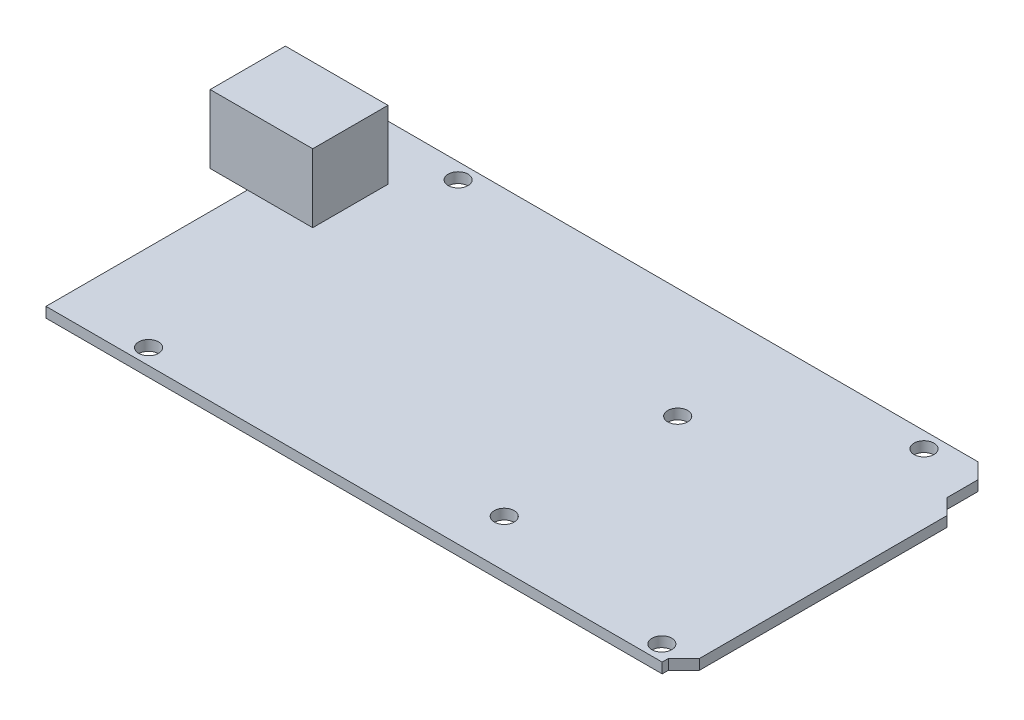
ISO-10303-21;
HEADER;
FILE_DESCRIPTION(('STEP AP214'),'2;1');
FILE_NAME('part.step','',(''),(''),'','','');
FILE_SCHEMA(('AUTOMOTIVE_DESIGN { 1 0 10303 214 1 1 1 1 }'));
ENDSEC;
DATA;
#1=APPLICATION_CONTEXT('core data for automotive mechanical design processes');
#2=APPLICATION_PROTOCOL_DEFINITION('international standard','automotive_design',2000,#1);
#3=PRODUCT_CONTEXT('',#1,'mechanical');
#4=PRODUCT('Part','Part','',(#3));
#5=PRODUCT_RELATED_PRODUCT_CATEGORY('part','',(#4));
#6=PRODUCT_DEFINITION_FORMATION('','',#4);
#7=PRODUCT_DEFINITION_CONTEXT('part definition',#1,'design');
#8=PRODUCT_DEFINITION('design','',#6,#7);
#9=PRODUCT_DEFINITION_SHAPE('','',#8);
#10=(LENGTH_UNIT() NAMED_UNIT(*) SI_UNIT(.MILLI.,.METRE.));
#11=(NAMED_UNIT(*) PLANE_ANGLE_UNIT() SI_UNIT($,.RADIAN.));
#12=(NAMED_UNIT(*) SI_UNIT($,.STERADIAN.) SOLID_ANGLE_UNIT());
#13=UNCERTAINTY_MEASURE_WITH_UNIT(LENGTH_MEASURE(1.E-05),#10,'distance_accuracy_value','');
#14=(GEOMETRIC_REPRESENTATION_CONTEXT(3) GLOBAL_UNCERTAINTY_ASSIGNED_CONTEXT((#13)) GLOBAL_UNIT_ASSIGNED_CONTEXT((#10,
#11,#12)) REPRESENTATION_CONTEXT('',''));
#15=CARTESIAN_POINT('',(0.,0.,0.));
#16=DIRECTION('',(0.,0.,1.));
#17=DIRECTION('',(1.,0.,0.));
#18=AXIS2_PLACEMENT_3D('',#15,#16,#17);
#19=CARTESIAN_POINT('',(0.,1.65,0.));
#20=DIRECTION('',(0.,-1.,0.));
#21=DIRECTION('',(0.,0.,-1.));
#22=AXIS2_PLACEMENT_3D('',#19,#20,#21);
#23=PLANE('',#22);
#24=CARTESIAN_POINT('',(66.1,1.65,-7.6));
#25=DIRECTION('',(0.,1.,0.));
#26=DIRECTION('',(0.,0.,1.));
#27=AXIS2_PLACEMENT_3D('',#24,#25,#26);
#28=CIRCLE('',#27,1.6);
#29=CARTESIAN_POINT('',(66.1,1.65,-5.99999999999999));
#30=VERTEX_POINT('',#29);
#31=EDGE_CURVE('E168',#30,#30,#28,.T.);
#32=ORIENTED_EDGE('',*,*,#31,.F.);
#33=EDGE_LOOP('',(#32));
#34=FACE_BOUND('',#33,.T.);
#35=CARTESIAN_POINT('',(66.1,1.65,-35.5));
#36=DIRECTION('',(0.,1.,0.));
#37=DIRECTION('',(0.,0.,1.));
#38=AXIS2_PLACEMENT_3D('',#35,#36,#37);
#39=CIRCLE('',#38,1.60000000000001);
#40=CARTESIAN_POINT('',(66.1,1.65,-33.9));
#41=VERTEX_POINT('',#40);
#42=EDGE_CURVE('E177',#41,#41,#39,.T.);
#43=ORIENTED_EDGE('',*,*,#42,.F.);
#44=EDGE_LOOP('',(#43));
#45=FACE_BOUND('',#44,.T.);
#46=CARTESIAN_POINT('',(90.454,1.65,-50.76));
#47=DIRECTION('',(0.,1.,0.));
#48=DIRECTION('',(0.,0.,1.));
#49=AXIS2_PLACEMENT_3D('',#46,#47,#48);
#50=CIRCLE('',#49,1.60000000000001);
#51=CARTESIAN_POINT('',(90.454,1.65,-49.16));
#52=VERTEX_POINT('',#51);
#53=EDGE_CURVE('E183',#52,#52,#50,.T.);
#54=ORIENTED_EDGE('',*,*,#53,.F.);
#55=EDGE_LOOP('',(#54));
#56=FACE_BOUND('',#55,.T.);
#57=CARTESIAN_POINT('',(15.524,1.65,-50.76));
#58=DIRECTION('',(0.,1.,0.));
#59=DIRECTION('',(0.,0.,1.));
#60=AXIS2_PLACEMENT_3D('',#57,#58,#59);
#61=CIRCLE('',#60,1.60000000000001);
#62=CARTESIAN_POINT('',(15.524,1.65,-49.16));
#63=VERTEX_POINT('',#62);
#64=EDGE_CURVE('E189',#63,#63,#61,.T.);
#65=ORIENTED_EDGE('',*,*,#64,.F.);
#66=EDGE_LOOP('',(#65));
#67=FACE_BOUND('',#66,.T.);
#68=CARTESIAN_POINT('',(96.55,1.65,-2.5));
#69=DIRECTION('',(0.,1.,0.));
#70=DIRECTION('',(0.,0.,1.));
#71=AXIS2_PLACEMENT_3D('',#68,#69,#70);
#72=CIRCLE('',#71,1.60000000000001);
#73=CARTESIAN_POINT('',(96.55,1.65,-0.899999999999995));
#74=VERTEX_POINT('',#73);
#75=EDGE_CURVE('E195',#74,#74,#72,.T.);
#76=ORIENTED_EDGE('',*,*,#75,.F.);
#77=EDGE_LOOP('',(#76));
#78=FACE_BOUND('',#77,.T.);
#79=CARTESIAN_POINT('',(14.,1.65,-2.5));
#80=DIRECTION('',(0.,1.,0.));
#81=DIRECTION('',(0.,0.,1.));
#82=AXIS2_PLACEMENT_3D('',#79,#80,#81);
#83=CIRCLE('',#82,1.6);
#84=CARTESIAN_POINT('',(14.,1.65,-0.899999999999998));
#85=VERTEX_POINT('',#84);
#86=EDGE_CURVE('E201',#85,#85,#83,.T.);
#87=ORIENTED_EDGE('',*,*,#86,.F.);
#88=EDGE_LOOP('',(#87));
#89=FACE_BOUND('',#88,.T.);
#90=DIRECTION('',(-1.,0.,0.));
#91=VECTOR('',#90,1.);
#92=CARTESIAN_POINT('',(-6.,1.65,-44.5));
#93=LINE('',#92,#91);
#94=CARTESIAN_POINT('',(10.5,1.65,-44.5));
#95=VERTEX_POINT('',#94);
#96=CARTESIAN_POINT('',(0.,1.65,-44.5));
#97=VERTEX_POINT('',#96);
#98=EDGE_CURVE('E56',#95,#97,#93,.T.);
#99=ORIENTED_EDGE('',*,*,#98,.F.);
#100=DIRECTION('',(0.,0.,-1.));
#101=VECTOR('',#100,1.);
#102=CARTESIAN_POINT('',(10.5,1.65,-44.5));
#103=LINE('',#102,#101);
#104=CARTESIAN_POINT('',(10.5,1.65,-32.4));
#105=VERTEX_POINT('',#104);
#106=EDGE_CURVE('E300',#105,#95,#103,.T.);
#107=ORIENTED_EDGE('',*,*,#106,.F.);
#108=DIRECTION('',(1.,0.,0.));
#109=VECTOR('',#108,1.);
#110=CARTESIAN_POINT('',(-6.,1.65,-32.4));
#111=LINE('',#110,#109);
#112=CARTESIAN_POINT('',(0.,1.65,-32.4));
#113=VERTEX_POINT('',#112);
#114=EDGE_CURVE('E11',#113,#105,#111,.T.);
#115=ORIENTED_EDGE('',*,*,#114,.F.);
#116=DIRECTION('',(0.,0.,1.));
#117=VECTOR('',#116,1.);
#118=CARTESIAN_POINT('',(0.,1.65,0.));
#119=LINE('',#118,#117);
#120=CARTESIAN_POINT('',(0.,1.65,0.));
#121=VERTEX_POINT('',#120);
#122=EDGE_CURVE('E211',#113,#121,#119,.T.);
#123=ORIENTED_EDGE('',*,*,#122,.T.);
#124=DIRECTION('',(1.,0.,0.));
#125=VECTOR('',#124,1.);
#126=CARTESIAN_POINT('',(0.,1.65,0.));
#127=LINE('',#126,#125);
#128=CARTESIAN_POINT('',(99.1,1.65,0.));
#129=VERTEX_POINT('',#128);
#130=EDGE_CURVE('E209',#121,#129,#127,.T.);
#131=ORIENTED_EDGE('',*,*,#130,.T.);
#132=DIRECTION('',(0.,0.,-1.));
#133=VECTOR('',#132,1.);
#134=CARTESIAN_POINT('',(99.1,1.65,0.));
#135=LINE('',#134,#133);
#136=CARTESIAN_POINT('',(99.1,1.65,-1.00000000000001));
#137=VERTEX_POINT('',#136);
#138=EDGE_CURVE('E213',#129,#137,#135,.T.);
#139=ORIENTED_EDGE('',*,*,#138,.T.);
#140=DIRECTION('',(0.707106781186549,0.,-0.707106781186547));
#141=VECTOR('',#140,1.);
#142=CARTESIAN_POINT('',(99.1,1.65,-1.00000000000001));
#143=LINE('',#142,#141);
#144=CARTESIAN_POINT('',(101.6,1.65,-3.5));
#145=VERTEX_POINT('',#144);
#146=EDGE_CURVE('E215',#137,#145,#143,.T.);
#147=ORIENTED_EDGE('',*,*,#146,.T.);
#148=DIRECTION('',(0.,0.,-1.));
#149=VECTOR('',#148,1.);
#150=CARTESIAN_POINT('',(101.6,1.65,-3.5));
#151=LINE('',#150,#149);
#152=CARTESIAN_POINT('',(101.6,1.65,-43.3));
#153=VERTEX_POINT('',#152);
#154=EDGE_CURVE('E217',#145,#153,#151,.T.);
#155=ORIENTED_EDGE('',*,*,#154,.T.);
#156=DIRECTION('',(-0.707106781186543,0.,-0.707106781186552));
#157=VECTOR('',#156,1.);
#158=CARTESIAN_POINT('',(101.6,1.65,-43.3));
#159=LINE('',#158,#157);
#160=CARTESIAN_POINT('',(99.1,1.65,-45.8));
#161=VERTEX_POINT('',#160);
#162=EDGE_CURVE('E219',#153,#161,#159,.T.);
#163=ORIENTED_EDGE('',*,*,#162,.T.);
#164=DIRECTION('',(0.,0.,-1.));
#165=VECTOR('',#164,1.);
#166=CARTESIAN_POINT('',(99.1,1.65,-45.8));
#167=LINE('',#166,#165);
#168=CARTESIAN_POINT('',(99.1,1.65,-50.8));
#169=VERTEX_POINT('',#168);
#170=EDGE_CURVE('E221',#161,#169,#167,.T.);
#171=ORIENTED_EDGE('',*,*,#170,.T.);
#172=DIRECTION('',(-0.707106781186551,0.,-0.707106781186545));
#173=VECTOR('',#172,1.);
#174=CARTESIAN_POINT('',(99.1,1.65,-50.8));
#175=LINE('',#174,#173);
#176=CARTESIAN_POINT('',(96.6,1.65,-53.3));
#177=VERTEX_POINT('',#176);
#178=EDGE_CURVE('E223',#169,#177,#175,.T.);
#179=ORIENTED_EDGE('',*,*,#178,.T.);
#180=DIRECTION('',(-1.,0.,0.));
#181=VECTOR('',#180,1.);
#182=CARTESIAN_POINT('',(0.,1.65,-53.3));
#183=LINE('',#182,#181);
#184=CARTESIAN_POINT('',(0.,1.65,-53.3));
#185=VERTEX_POINT('',#184);
#186=EDGE_CURVE('E225',#177,#185,#183,.T.);
#187=ORIENTED_EDGE('',*,*,#186,.T.);
#188=EDGE_CURVE('E207',#185,#97,#119,.T.);
#189=ORIENTED_EDGE('',*,*,#188,.T.);
#190=EDGE_LOOP('',(#99,#107,#115,#123,#131,#139,#147,#155,#163,#171,#179,#187,#189));
#191=FACE_BOUND('',#190,.T.);
#192=ADVANCED_FACE('F39',(#34,#45,#56,#67,#78,#89,#191),#23,.F.);
#193=CARTESIAN_POINT('',(0.,0.,0.));
#194=DIRECTION('',(0.,-1.,0.));
#195=DIRECTION('',(0.,0.,-1.));
#196=AXIS2_PLACEMENT_3D('',#193,#194,#195);
#197=PLANE('',#196);
#198=CARTESIAN_POINT('',(66.1,0.,-35.5));
#199=DIRECTION('',(0.,1.,0.));
#200=DIRECTION('',(0.,0.,1.));
#201=AXIS2_PLACEMENT_3D('',#198,#199,#200);
#202=CIRCLE('',#201,1.60000000000001);
#203=CARTESIAN_POINT('',(66.1,0.,-33.9));
#204=VERTEX_POINT('',#203);
#205=EDGE_CURVE('E175',#204,#204,#202,.T.);
#206=ORIENTED_EDGE('',*,*,#205,.T.);
#207=EDGE_LOOP('',(#206));
#208=FACE_BOUND('',#207,.T.);
#209=CARTESIAN_POINT('',(15.524,0.,-50.76));
#210=DIRECTION('',(0.,1.,0.));
#211=DIRECTION('',(0.,0.,1.));
#212=AXIS2_PLACEMENT_3D('',#209,#210,#211);
#213=CIRCLE('',#212,1.60000000000001);
#214=CARTESIAN_POINT('',(15.524,0.,-49.16));
#215=VERTEX_POINT('',#214);
#216=EDGE_CURVE('E186',#215,#215,#213,.T.);
#217=ORIENTED_EDGE('',*,*,#216,.T.);
#218=EDGE_LOOP('',(#217));
#219=FACE_BOUND('',#218,.T.);
#220=CARTESIAN_POINT('',(14.,0.,-2.5));
#221=DIRECTION('',(0.,1.,0.));
#222=DIRECTION('',(0.,0.,1.));
#223=AXIS2_PLACEMENT_3D('',#220,#221,#222);
#224=CIRCLE('',#223,1.6);
#225=CARTESIAN_POINT('',(14.,0.,-0.899999999999998));
#226=VERTEX_POINT('',#225);
#227=EDGE_CURVE('E198',#226,#226,#224,.T.);
#228=ORIENTED_EDGE('',*,*,#227,.T.);
#229=EDGE_LOOP('',(#228));
#230=FACE_BOUND('',#229,.T.);
#231=DIRECTION('',(0.,0.,1.));
#232=VECTOR('',#231,1.);
#233=CARTESIAN_POINT('',(0.,0.,0.));
#234=LINE('',#233,#232);
#235=CARTESIAN_POINT('',(0.,0.,-53.3));
#236=VERTEX_POINT('',#235);
#237=CARTESIAN_POINT('',(0.,0.,0.));
#238=VERTEX_POINT('',#237);
#239=EDGE_CURVE('E204',#236,#238,#234,.T.);
#240=ORIENTED_EDGE('',*,*,#239,.F.);
#241=DIRECTION('',(-1.,0.,0.));
#242=VECTOR('',#241,1.);
#243=CARTESIAN_POINT('',(0.,0.,-53.3));
#244=LINE('',#243,#242);
#245=CARTESIAN_POINT('',(96.6,0.,-53.3));
#246=VERTEX_POINT('',#245);
#247=EDGE_CURVE('E244',#246,#236,#244,.T.);
#248=ORIENTED_EDGE('',*,*,#247,.F.);
#249=DIRECTION('',(-0.707106781186551,0.,-0.707106781186545));
#250=VECTOR('',#249,1.);
#251=CARTESIAN_POINT('',(99.1,0.,-50.8));
#252=LINE('',#251,#250);
#253=CARTESIAN_POINT('',(99.1,0.,-50.8));
#254=VERTEX_POINT('',#253);
#255=EDGE_CURVE('E242',#254,#246,#252,.T.);
#256=ORIENTED_EDGE('',*,*,#255,.F.);
#257=DIRECTION('',(0.,0.,-1.));
#258=VECTOR('',#257,1.);
#259=CARTESIAN_POINT('',(99.1,0.,-45.8));
#260=LINE('',#259,#258);
#261=CARTESIAN_POINT('',(99.1,0.,-45.8));
#262=VERTEX_POINT('',#261);
#263=EDGE_CURVE('E240',#262,#254,#260,.T.);
#264=ORIENTED_EDGE('',*,*,#263,.F.);
#265=DIRECTION('',(-0.707106781186543,0.,-0.707106781186552));
#266=VECTOR('',#265,1.);
#267=CARTESIAN_POINT('',(101.6,0.,-43.3));
#268=LINE('',#267,#266);
#269=CARTESIAN_POINT('',(101.6,0.,-43.3));
#270=VERTEX_POINT('',#269);
#271=EDGE_CURVE('E238',#270,#262,#268,.T.);
#272=ORIENTED_EDGE('',*,*,#271,.F.);
#273=DIRECTION('',(0.,0.,-1.));
#274=VECTOR('',#273,1.);
#275=CARTESIAN_POINT('',(101.6,0.,-3.5));
#276=LINE('',#275,#274);
#277=CARTESIAN_POINT('',(101.6,0.,-3.5));
#278=VERTEX_POINT('',#277);
#279=EDGE_CURVE('E236',#278,#270,#276,.T.);
#280=ORIENTED_EDGE('',*,*,#279,.F.);
#281=DIRECTION('',(0.707106781186549,0.,-0.707106781186547));
#282=VECTOR('',#281,1.);
#283=CARTESIAN_POINT('',(99.1,0.,-1.00000000000001));
#284=LINE('',#283,#282);
#285=CARTESIAN_POINT('',(99.1,0.,-1.00000000000001));
#286=VERTEX_POINT('',#285);
#287=EDGE_CURVE('E234',#286,#278,#284,.T.);
#288=ORIENTED_EDGE('',*,*,#287,.F.);
#289=DIRECTION('',(0.,0.,-1.));
#290=VECTOR('',#289,1.);
#291=CARTESIAN_POINT('',(99.1,0.,0.));
#292=LINE('',#291,#290);
#293=CARTESIAN_POINT('',(99.1,0.,0.));
#294=VERTEX_POINT('',#293);
#295=EDGE_CURVE('E232',#294,#286,#292,.T.);
#296=ORIENTED_EDGE('',*,*,#295,.F.);
#297=DIRECTION('',(1.,0.,0.));
#298=VECTOR('',#297,1.);
#299=CARTESIAN_POINT('',(0.,0.,0.));
#300=LINE('',#299,#298);
#301=EDGE_CURVE('E230',#238,#294,#300,.T.);
#302=ORIENTED_EDGE('',*,*,#301,.F.);
#303=EDGE_LOOP('',(#240,#248,#256,#264,#272,#280,#288,#296,#302));
#304=FACE_BOUND('',#303,.T.);
#305=CARTESIAN_POINT('',(96.55,0.,-2.5));
#306=DIRECTION('',(0.,1.,0.));
#307=DIRECTION('',(0.,0.,1.));
#308=AXIS2_PLACEMENT_3D('',#305,#306,#307);
#309=CIRCLE('',#308,1.60000000000001);
#310=CARTESIAN_POINT('',(96.55,0.,-0.899999999999995));
#311=VERTEX_POINT('',#310);
#312=EDGE_CURVE('E192',#311,#311,#309,.T.);
#313=ORIENTED_EDGE('',*,*,#312,.T.);
#314=EDGE_LOOP('',(#313));
#315=FACE_BOUND('',#314,.T.);
#316=CARTESIAN_POINT('',(90.454,0.,-50.76));
#317=DIRECTION('',(0.,1.,0.));
#318=DIRECTION('',(0.,0.,1.));
#319=AXIS2_PLACEMENT_3D('',#316,#317,#318);
#320=CIRCLE('',#319,1.60000000000001);
#321=CARTESIAN_POINT('',(90.454,0.,-49.16));
#322=VERTEX_POINT('',#321);
#323=EDGE_CURVE('E180',#322,#322,#320,.T.);
#324=ORIENTED_EDGE('',*,*,#323,.T.);
#325=EDGE_LOOP('',(#324));
#326=FACE_BOUND('',#325,.T.);
#327=CARTESIAN_POINT('',(66.1,0.,-7.6));
#328=DIRECTION('',(0.,1.,0.));
#329=DIRECTION('',(0.,0.,1.));
#330=AXIS2_PLACEMENT_3D('',#327,#328,#329);
#331=CIRCLE('',#330,1.6);
#332=CARTESIAN_POINT('',(66.1,0.,-5.99999999999999));
#333=VERTEX_POINT('',#332);
#334=EDGE_CURVE('E165',#333,#333,#331,.T.);
#335=ORIENTED_EDGE('',*,*,#334,.T.);
#336=EDGE_LOOP('',(#335));
#337=FACE_BOUND('',#336,.T.);
#338=ADVANCED_FACE('F282',(#208,#219,#230,#304,#315,#326,#337),#197,.T.);
#339=CARTESIAN_POINT('',(0.,1.65,0.));
#340=DIRECTION('',(1.,0.,0.));
#341=DIRECTION('',(0.,0.,-1.));
#342=AXIS2_PLACEMENT_3D('',#339,#340,#341);
#343=PLANE('',#342);
#344=ORIENTED_EDGE('',*,*,#239,.T.);
#345=DIRECTION('',(0.,-1.,0.));
#346=VECTOR('',#345,1.);
#347=CARTESIAN_POINT('',(0.,1.65,0.));
#348=LINE('',#347,#346);
#349=EDGE_CURVE('E43',#121,#238,#348,.T.);
#350=ORIENTED_EDGE('',*,*,#349,.F.);
#351=ORIENTED_EDGE('',*,*,#122,.F.);
#352=EDGE_CURVE('E210',#97,#113,#119,.T.);
#353=ORIENTED_EDGE('',*,*,#352,.F.);
#354=ORIENTED_EDGE('',*,*,#188,.F.);
#355=DIRECTION('',(0.,-1.,0.));
#356=VECTOR('',#355,1.);
#357=CARTESIAN_POINT('',(0.,1.65,-53.3));
#358=LINE('',#357,#356);
#359=EDGE_CURVE('E227',#185,#236,#358,.T.);
#360=ORIENTED_EDGE('',*,*,#359,.T.);
#361=EDGE_LOOP('',(#344,#350,#351,#353,#354,#360));
#362=FACE_BOUND('',#361,.T.);
#363=ADVANCED_FACE('F41',(#362),#343,.F.);
#364=CARTESIAN_POINT('',(0.,1.65,0.));
#365=DIRECTION('',(0.,0.,-1.));
#366=DIRECTION('',(-1.,0.,0.));
#367=AXIS2_PLACEMENT_3D('',#364,#365,#366);
#368=PLANE('',#367);
#369=ORIENTED_EDGE('',*,*,#301,.T.);
#370=DIRECTION('',(0.,-1.,0.));
#371=VECTOR('',#370,1.);
#372=CARTESIAN_POINT('',(99.1,1.65,0.));
#373=LINE('',#372,#371);
#374=EDGE_CURVE('E265',#129,#294,#373,.T.);
#375=ORIENTED_EDGE('',*,*,#374,.F.);
#376=ORIENTED_EDGE('',*,*,#130,.F.);
#377=ORIENTED_EDGE('',*,*,#349,.T.);
#378=EDGE_LOOP('',(#369,#375,#376,#377));
#379=FACE_BOUND('',#378,.T.);
#380=ADVANCED_FACE('F275',(#379),#368,.F.);
#381=CARTESIAN_POINT('',(99.1,1.65,0.));
#382=DIRECTION('',(-1.,0.,0.));
#383=DIRECTION('',(0.,0.,1.));
#384=AXIS2_PLACEMENT_3D('',#381,#382,#383);
#385=PLANE('',#384);
#386=ORIENTED_EDGE('',*,*,#295,.T.);
#387=DIRECTION('',(0.,-1.,0.));
#388=VECTOR('',#387,1.);
#389=CARTESIAN_POINT('',(99.1,1.65,-1.00000000000001));
#390=LINE('',#389,#388);
#391=EDGE_CURVE('E263',#137,#286,#390,.T.);
#392=ORIENTED_EDGE('',*,*,#391,.F.);
#393=ORIENTED_EDGE('',*,*,#138,.F.);
#394=ORIENTED_EDGE('',*,*,#374,.T.);
#395=EDGE_LOOP('',(#386,#392,#393,#394));
#396=FACE_BOUND('',#395,.T.);
#397=ADVANCED_FACE('F288',(#396),#385,.F.);
#398=CARTESIAN_POINT('',(99.1,1.65,-1.00000000000001));
#399=DIRECTION('',(-0.707106781186547,0.,-0.707106781186549));
#400=DIRECTION('',(-0.707106781186549,0.,0.707106781186546));
#401=AXIS2_PLACEMENT_3D('',#398,#399,#400);
#402=PLANE('',#401);
#403=ORIENTED_EDGE('',*,*,#287,.T.);
#404=DIRECTION('',(0.,-1.,0.));
#405=VECTOR('',#404,1.);
#406=CARTESIAN_POINT('',(101.6,1.65,-3.5));
#407=LINE('',#406,#405);
#408=EDGE_CURVE('E260',#145,#278,#407,.T.);
#409=ORIENTED_EDGE('',*,*,#408,.F.);
#410=ORIENTED_EDGE('',*,*,#146,.F.);
#411=ORIENTED_EDGE('',*,*,#391,.T.);
#412=EDGE_LOOP('',(#403,#409,#410,#411));
#413=FACE_BOUND('',#412,.T.);
#414=ADVANCED_FACE('F291',(#413),#402,.F.);
#415=CARTESIAN_POINT('',(101.6,1.65,-3.5));
#416=DIRECTION('',(-1.,0.,0.));
#417=DIRECTION('',(0.,0.,1.));
#418=AXIS2_PLACEMENT_3D('',#415,#416,#417);
#419=PLANE('',#418);
#420=ORIENTED_EDGE('',*,*,#279,.T.);
#421=DIRECTION('',(0.,-1.,0.));
#422=VECTOR('',#421,1.);
#423=CARTESIAN_POINT('',(101.6,1.65,-43.3));
#424=LINE('',#423,#422);
#425=EDGE_CURVE('E257',#153,#270,#424,.T.);
#426=ORIENTED_EDGE('',*,*,#425,.F.);
#427=ORIENTED_EDGE('',*,*,#154,.F.);
#428=ORIENTED_EDGE('',*,*,#408,.T.);
#429=EDGE_LOOP('',(#420,#426,#427,#428));
#430=FACE_BOUND('',#429,.T.);
#431=ADVANCED_FACE('F353',(#430),#419,.F.);
#432=CARTESIAN_POINT('',(101.6,1.65,-43.3));
#433=DIRECTION('',(-0.707106781186552,0.,0.707106781186543));
#434=DIRECTION('',(0.707106781186543,0.,0.707106781186552));
#435=AXIS2_PLACEMENT_3D('',#432,#433,#434);
#436=PLANE('',#435);
#437=ORIENTED_EDGE('',*,*,#271,.T.);
#438=DIRECTION('',(0.,-1.,0.));
#439=VECTOR('',#438,1.);
#440=CARTESIAN_POINT('',(99.1,1.65,-45.8));
#441=LINE('',#440,#439);
#442=EDGE_CURVE('E254',#161,#262,#441,.T.);
#443=ORIENTED_EDGE('',*,*,#442,.F.);
#444=ORIENTED_EDGE('',*,*,#162,.F.);
#445=ORIENTED_EDGE('',*,*,#425,.T.);
#446=EDGE_LOOP('',(#437,#443,#444,#445));
#447=FACE_BOUND('',#446,.T.);
#448=ADVANCED_FACE('F349',(#447),#436,.F.);
#449=CARTESIAN_POINT('',(99.1,1.65,-45.8));
#450=DIRECTION('',(-1.,0.,0.));
#451=DIRECTION('',(0.,0.,1.));
#452=AXIS2_PLACEMENT_3D('',#449,#450,#451);
#453=PLANE('',#452);
#454=ORIENTED_EDGE('',*,*,#263,.T.);
#455=DIRECTION('',(0.,-1.,0.));
#456=VECTOR('',#455,1.);
#457=CARTESIAN_POINT('',(99.1,1.65,-50.8));
#458=LINE('',#457,#456);
#459=EDGE_CURVE('E251',#169,#254,#458,.T.);
#460=ORIENTED_EDGE('',*,*,#459,.F.);
#461=ORIENTED_EDGE('',*,*,#170,.F.);
#462=ORIENTED_EDGE('',*,*,#442,.T.);
#463=EDGE_LOOP('',(#454,#460,#461,#462));
#464=FACE_BOUND('',#463,.T.);
#465=ADVANCED_FACE('F345',(#464),#453,.F.);
#466=CARTESIAN_POINT('',(99.1,1.65,-50.8));
#467=DIRECTION('',(-0.707106781186545,0.,0.707106781186551));
#468=DIRECTION('',(0.707106781186551,0.,0.707106781186545));
#469=AXIS2_PLACEMENT_3D('',#466,#467,#468);
#470=PLANE('',#469);
#471=ORIENTED_EDGE('',*,*,#255,.T.);
#472=DIRECTION('',(0.,-1.,0.));
#473=VECTOR('',#472,1.);
#474=CARTESIAN_POINT('',(96.6,1.65,-53.3));
#475=LINE('',#474,#473);
#476=EDGE_CURVE('E248',#177,#246,#475,.T.);
#477=ORIENTED_EDGE('',*,*,#476,.F.);
#478=ORIENTED_EDGE('',*,*,#178,.F.);
#479=ORIENTED_EDGE('',*,*,#459,.T.);
#480=EDGE_LOOP('',(#471,#477,#478,#479));
#481=FACE_BOUND('',#480,.T.);
#482=ADVANCED_FACE('F341',(#481),#470,.F.);
#483=CARTESIAN_POINT('',(0.,1.65,-53.3));
#484=DIRECTION('',(0.,0.,1.));
#485=DIRECTION('',(1.,0.,0.));
#486=AXIS2_PLACEMENT_3D('',#483,#484,#485);
#487=PLANE('',#486);
#488=ORIENTED_EDGE('',*,*,#247,.T.);
#489=ORIENTED_EDGE('',*,*,#359,.F.);
#490=ORIENTED_EDGE('',*,*,#186,.F.);
#491=ORIENTED_EDGE('',*,*,#476,.T.);
#492=EDGE_LOOP('',(#488,#489,#490,#491));
#493=FACE_BOUND('',#492,.T.);
#494=ADVANCED_FACE('F338',(#493),#487,.F.);
#495=CARTESIAN_POINT('',(14.,1.65,-2.5));
#496=DIRECTION('',(0.,-1.,0.));
#497=DIRECTION('',(0.,0.,-1.));
#498=AXIS2_PLACEMENT_3D('',#495,#496,#497);
#499=CYLINDRICAL_SURFACE('',#498,1.6);
#500=ORIENTED_EDGE('',*,*,#86,.T.);
#501=EDGE_LOOP('',(#500));
#502=FACE_BOUND('',#501,.T.);
#503=ORIENTED_EDGE('',*,*,#227,.F.);
#504=EDGE_LOOP('',(#503));
#505=FACE_BOUND('',#504,.T.);
#506=ADVANCED_FACE('F335',(#502,#505),#499,.F.);
#507=CARTESIAN_POINT('',(96.55,1.65,-2.5));
#508=DIRECTION('',(0.,-1.,0.));
#509=DIRECTION('',(0.,0.,-1.));
#510=AXIS2_PLACEMENT_3D('',#507,#508,#509);
#511=CYLINDRICAL_SURFACE('',#510,1.60000000000001);
#512=ORIENTED_EDGE('',*,*,#75,.T.);
#513=EDGE_LOOP('',(#512));
#514=FACE_BOUND('',#513,.T.);
#515=ORIENTED_EDGE('',*,*,#312,.F.);
#516=EDGE_LOOP('',(#515));
#517=FACE_BOUND('',#516,.T.);
#518=ADVANCED_FACE('F411',(#514,#517),#511,.F.);
#519=CARTESIAN_POINT('',(15.524,1.65,-50.76));
#520=DIRECTION('',(0.,-1.,0.));
#521=DIRECTION('',(0.,0.,-1.));
#522=AXIS2_PLACEMENT_3D('',#519,#520,#521);
#523=CYLINDRICAL_SURFACE('',#522,1.60000000000001);
#524=ORIENTED_EDGE('',*,*,#64,.T.);
#525=EDGE_LOOP('',(#524));
#526=FACE_BOUND('',#525,.T.);
#527=ORIENTED_EDGE('',*,*,#216,.F.);
#528=EDGE_LOOP('',(#527));
#529=FACE_BOUND('',#528,.T.);
#530=ADVANCED_FACE('F408',(#526,#529),#523,.F.);
#531=CARTESIAN_POINT('',(90.454,1.65,-50.76));
#532=DIRECTION('',(0.,-1.,0.));
#533=DIRECTION('',(0.,0.,-1.));
#534=AXIS2_PLACEMENT_3D('',#531,#532,#533);
#535=CYLINDRICAL_SURFACE('',#534,1.60000000000001);
#536=ORIENTED_EDGE('',*,*,#53,.T.);
#537=EDGE_LOOP('',(#536));
#538=FACE_BOUND('',#537,.T.);
#539=ORIENTED_EDGE('',*,*,#323,.F.);
#540=EDGE_LOOP('',(#539));
#541=FACE_BOUND('',#540,.T.);
#542=ADVANCED_FACE('F404',(#538,#541),#535,.F.);
#543=CARTESIAN_POINT('',(66.1,1.65,-35.5));
#544=DIRECTION('',(0.,-1.,0.));
#545=DIRECTION('',(0.,0.,-1.));
#546=AXIS2_PLACEMENT_3D('',#543,#544,#545);
#547=CYLINDRICAL_SURFACE('',#546,1.60000000000001);
#548=ORIENTED_EDGE('',*,*,#42,.T.);
#549=EDGE_LOOP('',(#548));
#550=FACE_BOUND('',#549,.T.);
#551=ORIENTED_EDGE('',*,*,#205,.F.);
#552=EDGE_LOOP('',(#551));
#553=FACE_BOUND('',#552,.T.);
#554=ADVANCED_FACE('F400',(#550,#553),#547,.F.);
#555=CARTESIAN_POINT('',(66.1,1.65,-7.6));
#556=DIRECTION('',(0.,-1.,0.));
#557=DIRECTION('',(0.,0.,-1.));
#558=AXIS2_PLACEMENT_3D('',#555,#556,#557);
#559=CYLINDRICAL_SURFACE('',#558,1.6);
#560=ORIENTED_EDGE('',*,*,#31,.T.);
#561=EDGE_LOOP('',(#560));
#562=FACE_BOUND('',#561,.T.);
#563=ORIENTED_EDGE('',*,*,#334,.F.);
#564=EDGE_LOOP('',(#563));
#565=FACE_BOUND('',#564,.T.);
#566=ADVANCED_FACE('F373',(#562,#565),#559,.F.);
#567=CARTESIAN_POINT('',(0.,1.65,0.));
#568=DIRECTION('',(0.,1.,0.));
#569=DIRECTION('',(0.,0.,1.));
#570=AXIS2_PLACEMENT_3D('',#567,#568,#569);
#571=PLANE('',#570);
#572=CARTESIAN_POINT('',(-6.,1.65,-44.5));
#573=VERTEX_POINT('',#572);
#574=EDGE_CURVE('E299',#97,#573,#93,.T.);
#575=ORIENTED_EDGE('',*,*,#574,.F.);
#576=ORIENTED_EDGE('',*,*,#352,.T.);
#577=CARTESIAN_POINT('',(-6.,1.65,-32.4));
#578=VERTEX_POINT('',#577);
#579=EDGE_CURVE('E49',#578,#113,#111,.T.);
#580=ORIENTED_EDGE('',*,*,#579,.F.);
#581=DIRECTION('',(0.,0.,1.));
#582=VECTOR('',#581,1.);
#583=CARTESIAN_POINT('',(-6.,1.65,-44.5));
#584=LINE('',#583,#582);
#585=EDGE_CURVE('E164',#573,#578,#584,.T.);
#586=ORIENTED_EDGE('',*,*,#585,.F.);
#587=EDGE_LOOP('',(#575,#576,#580,#586));
#588=FACE_BOUND('',#587,.T.);
#589=ADVANCED_FACE('F298',(#588),#571,.F.);
#590=CARTESIAN_POINT('',(-6.,12.65,-44.5));
#591=DIRECTION('',(1.,0.,0.));
#592=DIRECTION('',(0.,0.,-1.));
#593=AXIS2_PLACEMENT_3D('',#590,#591,#592);
#594=PLANE('',#593);
#595=ORIENTED_EDGE('',*,*,#585,.T.);
#596=DIRECTION('',(0.,-1.,0.));
#597=VECTOR('',#596,1.);
#598=CARTESIAN_POINT('',(-6.,12.65,-32.4));
#599=LINE('',#598,#597);
#600=CARTESIAN_POINT('',(-6.,12.65,-32.4));
#601=VERTEX_POINT('',#600);
#602=EDGE_CURVE('E145',#601,#578,#599,.T.);
#603=ORIENTED_EDGE('',*,*,#602,.F.);
#604=DIRECTION('',(0.,0.,1.));
#605=VECTOR('',#604,1.);
#606=CARTESIAN_POINT('',(-6.,12.65,-44.5));
#607=LINE('',#606,#605);
#608=CARTESIAN_POINT('',(-6.,12.65,-44.5));
#609=VERTEX_POINT('',#608);
#610=EDGE_CURVE('E152',#609,#601,#607,.T.);
#611=ORIENTED_EDGE('',*,*,#610,.F.);
#612=DIRECTION('',(0.,-1.,0.));
#613=VECTOR('',#612,1.);
#614=CARTESIAN_POINT('',(-6.,12.65,-44.5));
#615=LINE('',#614,#613);
#616=EDGE_CURVE('E306',#609,#573,#615,.T.);
#617=ORIENTED_EDGE('',*,*,#616,.T.);
#618=EDGE_LOOP('',(#595,#603,#611,#617));
#619=FACE_BOUND('',#618,.T.);
#620=ADVANCED_FACE('F162',(#619),#594,.F.);
#621=CARTESIAN_POINT('',(-6.,12.65,-32.4));
#622=DIRECTION('',(0.,0.,-1.));
#623=DIRECTION('',(-1.,0.,0.));
#624=AXIS2_PLACEMENT_3D('',#621,#622,#623);
#625=PLANE('',#624);
#626=ORIENTED_EDGE('',*,*,#579,.T.);
#627=ORIENTED_EDGE('',*,*,#114,.T.);
#628=DIRECTION('',(0.,-1.,0.));
#629=VECTOR('',#628,1.);
#630=CARTESIAN_POINT('',(10.5,12.65,-32.4));
#631=LINE('',#630,#629);
#632=CARTESIAN_POINT('',(10.5,12.65,-32.4));
#633=VERTEX_POINT('',#632);
#634=EDGE_CURVE('E148',#633,#105,#631,.T.);
#635=ORIENTED_EDGE('',*,*,#634,.F.);
#636=DIRECTION('',(1.,0.,0.));
#637=VECTOR('',#636,1.);
#638=CARTESIAN_POINT('',(-6.,12.65,-32.4));
#639=LINE('',#638,#637);
#640=EDGE_CURVE('E140',#601,#633,#639,.T.);
#641=ORIENTED_EDGE('',*,*,#640,.F.);
#642=ORIENTED_EDGE('',*,*,#602,.T.);
#643=EDGE_LOOP('',(#626,#627,#635,#641,#642));
#644=FACE_BOUND('',#643,.T.);
#645=ADVANCED_FACE('F143',(#644),#625,.F.);
#646=CARTESIAN_POINT('',(10.5,12.65,-44.5));
#647=DIRECTION('',(-1.,0.,0.));
#648=DIRECTION('',(0.,0.,1.));
#649=AXIS2_PLACEMENT_3D('',#646,#647,#648);
#650=PLANE('',#649);
#651=ORIENTED_EDGE('',*,*,#106,.T.);
#652=DIRECTION('',(0.,-1.,0.));
#653=VECTOR('',#652,1.);
#654=CARTESIAN_POINT('',(10.5,12.65,-44.5));
#655=LINE('',#654,#653);
#656=CARTESIAN_POINT('',(10.5,12.65,-44.5));
#657=VERTEX_POINT('',#656);
#658=EDGE_CURVE('E170',#657,#95,#655,.T.);
#659=ORIENTED_EDGE('',*,*,#658,.F.);
#660=DIRECTION('',(0.,0.,-1.));
#661=VECTOR('',#660,1.);
#662=CARTESIAN_POINT('',(10.5,12.65,-44.5));
#663=LINE('',#662,#661);
#664=EDGE_CURVE('E151',#633,#657,#663,.T.);
#665=ORIENTED_EDGE('',*,*,#664,.F.);
#666=ORIENTED_EDGE('',*,*,#634,.T.);
#667=EDGE_LOOP('',(#651,#659,#665,#666));
#668=FACE_BOUND('',#667,.T.);
#669=ADVANCED_FACE('F312',(#668),#650,.F.);
#670=CARTESIAN_POINT('',(-6.,12.65,-44.5));
#671=DIRECTION('',(0.,0.,1.));
#672=DIRECTION('',(1.,0.,0.));
#673=AXIS2_PLACEMENT_3D('',#670,#671,#672);
#674=PLANE('',#673);
#675=ORIENTED_EDGE('',*,*,#98,.T.);
#676=ORIENTED_EDGE('',*,*,#574,.T.);
#677=ORIENTED_EDGE('',*,*,#616,.F.);
#678=DIRECTION('',(-1.,0.,0.));
#679=VECTOR('',#678,1.);
#680=CARTESIAN_POINT('',(-6.,12.65,-44.5));
#681=LINE('',#680,#679);
#682=EDGE_CURVE('E157',#657,#609,#681,.T.);
#683=ORIENTED_EDGE('',*,*,#682,.F.);
#684=ORIENTED_EDGE('',*,*,#658,.T.);
#685=EDGE_LOOP('',(#675,#676,#677,#683,#684));
#686=FACE_BOUND('',#685,.T.);
#687=ADVANCED_FACE('F310',(#686),#674,.F.);
#688=CARTESIAN_POINT('',(0.,12.65,0.));
#689=DIRECTION('',(0.,1.,0.));
#690=DIRECTION('',(0.,0.,1.));
#691=AXIS2_PLACEMENT_3D('',#688,#689,#690);
#692=PLANE('',#691);
#693=ORIENTED_EDGE('',*,*,#610,.T.);
#694=ORIENTED_EDGE('',*,*,#640,.T.);
#695=ORIENTED_EDGE('',*,*,#664,.T.);
#696=ORIENTED_EDGE('',*,*,#682,.T.);
#697=EDGE_LOOP('',(#693,#694,#695,#696));
#698=FACE_BOUND('',#697,.T.);
#699=ADVANCED_FACE('F155',(#698),#692,.T.);
#700=CLOSED_SHELL('',(#192,#338,#363,#380,#397,#414,#431,#448,#465,#482,#494,#506,#518,#530,
#542,#554,#566,#589,#620,#645,#669,#687,#699));
#701=MANIFOLD_SOLID_BREP('B2',#700);
#702=ADVANCED_BREP_SHAPE_REPRESENTATION('',(#18,#701),#14);
#703=SHAPE_DEFINITION_REPRESENTATION(#9,#702);
ENDSEC;
END-ISO-10303-21;
